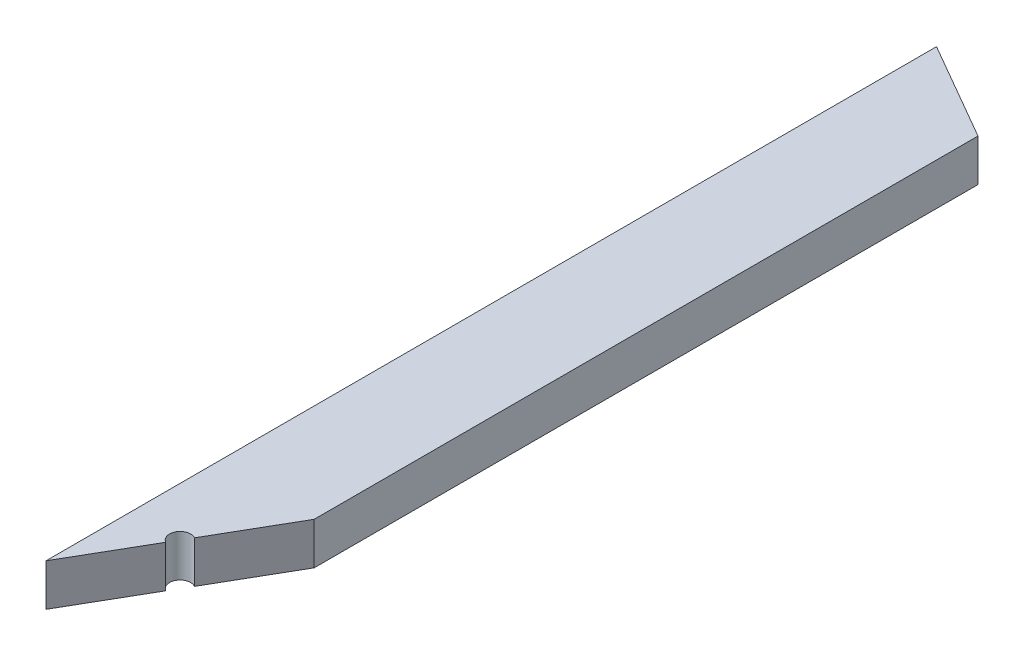
ISO-10303-21;
HEADER;
FILE_DESCRIPTION(('STEP AP214'),'2;1');
FILE_NAME('part.step','',(''),(''),'','','');
FILE_SCHEMA(('AUTOMOTIVE_DESIGN { 1 0 10303 214 1 1 1 1 }'));
ENDSEC;
DATA;
#1=APPLICATION_CONTEXT('core data for automotive mechanical design processes');
#2=APPLICATION_PROTOCOL_DEFINITION('international standard','automotive_design',2000,#1);
#3=PRODUCT_CONTEXT('',#1,'mechanical');
#4=PRODUCT('Part','Part','',(#3));
#5=PRODUCT_RELATED_PRODUCT_CATEGORY('part','',(#4));
#6=PRODUCT_DEFINITION_FORMATION('','',#4);
#7=PRODUCT_DEFINITION_CONTEXT('part definition',#1,'design');
#8=PRODUCT_DEFINITION('design','',#6,#7);
#9=PRODUCT_DEFINITION_SHAPE('','',#8);
#10=(LENGTH_UNIT() NAMED_UNIT(*) SI_UNIT(.MILLI.,.METRE.));
#11=(NAMED_UNIT(*) PLANE_ANGLE_UNIT() SI_UNIT($,.RADIAN.));
#12=(NAMED_UNIT(*) SI_UNIT($,.STERADIAN.) SOLID_ANGLE_UNIT());
#13=UNCERTAINTY_MEASURE_WITH_UNIT(LENGTH_MEASURE(1.E-05),#10,'distance_accuracy_value','');
#14=(GEOMETRIC_REPRESENTATION_CONTEXT(3) GLOBAL_UNCERTAINTY_ASSIGNED_CONTEXT((#13)) GLOBAL_UNIT_ASSIGNED_CONTEXT((#10,
#11,#12)) REPRESENTATION_CONTEXT('',''));
#15=CARTESIAN_POINT('',(0.,0.,0.));
#16=DIRECTION('',(0.,0.,1.));
#17=DIRECTION('',(1.,0.,0.));
#18=AXIS2_PLACEMENT_3D('',#15,#16,#17);
#19=CARTESIAN_POINT('',(-44.45,-19.05,806.55922));
#20=DIRECTION('',(-0.866025403784436,0.,-0.500000000000004));
#21=DIRECTION('',(-0.500000000000004,0.,0.866025403784436));
#22=AXIS2_PLACEMENT_3D('',#19,#20,#21);
#23=PLANE('',#22);
#24=DIRECTION('',(-0.500000000000004,0.,0.866025403784436));
#25=VECTOR('',#24,1.);
#26=CARTESIAN_POINT('',(-44.45,-19.05,806.55922));
#27=LINE('',#26,#25);
#28=CARTESIAN_POINT('',(-4.76250000000004,-19.05,737.818453574611));
#29=VERTEX_POINT('',#28);
#30=CARTESIAN_POINT('',(-44.45,-19.05,806.55922));
#31=VERTEX_POINT('',#30);
#32=EDGE_CURVE('E128',#29,#31,#27,.T.);
#33=ORIENTED_EDGE('',*,*,#32,.F.);
#34=DIRECTION('',(0.,1.,0.));
#35=VECTOR('',#34,1.);
#36=CARTESIAN_POINT('',(-4.76250000000004,-19.05,737.818453574611));
#37=LINE('',#36,#35);
#38=CARTESIAN_POINT('',(-4.76250000000004,19.05,737.818453574611));
#39=VERTEX_POINT('',#38);
#40=EDGE_CURVE('E11',#29,#39,#37,.T.);
#41=ORIENTED_EDGE('',*,*,#40,.T.);
#42=DIRECTION('',(-0.500000000000004,0.,0.866025403784436));
#43=VECTOR('',#42,1.);
#44=CARTESIAN_POINT('',(-44.45,19.05,806.55922));
#45=LINE('',#44,#43);
#46=CARTESIAN_POINT('',(-44.45,19.05,806.55922));
#47=VERTEX_POINT('',#46);
#48=EDGE_CURVE('E68',#39,#47,#45,.T.);
#49=ORIENTED_EDGE('',*,*,#48,.T.);
#50=DIRECTION('',(0.,-1.,0.));
#51=VECTOR('',#50,1.);
#52=CARTESIAN_POINT('',(-44.45,-19.05,806.55922));
#53=LINE('',#52,#51);
#54=EDGE_CURVE('E129',#47,#31,#53,.T.);
#55=ORIENTED_EDGE('',*,*,#54,.T.);
#56=EDGE_LOOP('',(#33,#41,#49,#55));
#57=FACE_BOUND('',#56,.T.);
#58=ADVANCED_FACE('F44',(#57),#23,.F.);
#59=CARTESIAN_POINT('',(44.45,-19.05,806.55922));
#60=DIRECTION('',(-1.,0.,0.));
#61=DIRECTION('',(0.,0.,1.));
#62=AXIS2_PLACEMENT_3D('',#59,#60,#61);
#63=PLANE('',#62);
#64=DIRECTION('',(0.,0.,-1.));
#65=VECTOR('',#64,1.);
#66=CARTESIAN_POINT('',(44.45,-19.05,806.55922));
#67=LINE('',#66,#65);
#68=CARTESIAN_POINT('',(44.45,-19.05,652.579903207128));
#69=VERTEX_POINT('',#68);
#70=CARTESIAN_POINT('',(44.45,-19.05,51.326438930957));
#71=VERTEX_POINT('',#70);
#72=EDGE_CURVE('E132',#69,#71,#67,.T.);
#73=ORIENTED_EDGE('',*,*,#72,.T.);
#74=DIRECTION('',(0.,1.,0.));
#75=VECTOR('',#74,1.);
#76=CARTESIAN_POINT('',(44.45,-19.05,51.326438930957));
#77=LINE('',#76,#75);
#78=CARTESIAN_POINT('',(44.45,19.05,51.326438930957));
#79=VERTEX_POINT('',#78);
#80=EDGE_CURVE('E137',#71,#79,#77,.T.);
#81=ORIENTED_EDGE('',*,*,#80,.T.);
#82=DIRECTION('',(0.,0.,-1.));
#83=VECTOR('',#82,1.);
#84=CARTESIAN_POINT('',(44.45,19.05,806.55922));
#85=LINE('',#84,#83);
#86=CARTESIAN_POINT('',(44.45,19.05,652.579903207128));
#87=VERTEX_POINT('',#86);
#88=EDGE_CURVE('E103',#87,#79,#85,.T.);
#89=ORIENTED_EDGE('',*,*,#88,.F.);
#90=DIRECTION('',(0.,1.,0.));
#91=VECTOR('',#90,1.);
#92=CARTESIAN_POINT('',(44.45,-19.05,652.579903207128));
#93=LINE('',#92,#91);
#94=EDGE_CURVE('E114',#69,#87,#93,.T.);
#95=ORIENTED_EDGE('',*,*,#94,.F.);
#96=EDGE_LOOP('',(#73,#81,#89,#95));
#97=FACE_BOUND('',#96,.T.);
#98=ADVANCED_FACE('F46',(#97),#63,.F.);
#99=CARTESIAN_POINT('',(-44.45,19.05,806.55922));
#100=DIRECTION('',(0.,-1.,0.));
#101=DIRECTION('',(0.,0.,-1.));
#102=AXIS2_PLACEMENT_3D('',#99,#100,#101);
#103=PLANE('',#102);
#104=ORIENTED_EDGE('',*,*,#48,.F.);
#105=CARTESIAN_POINT('',(0.,19.05,729.569561603564));
#106=DIRECTION('',(0.,1.,0.));
#107=DIRECTION('',(0.,0.,1.));
#108=AXIS2_PLACEMENT_3D('',#105,#106,#107);
#109=CIRCLE('',#108,9.525);
#110=CARTESIAN_POINT('',(4.76250000000003,19.05,721.320669632517));
#111=VERTEX_POINT('',#110);
#112=EDGE_CURVE('E98',#111,#39,#109,.T.);
#113=ORIENTED_EDGE('',*,*,#112,.F.);
#114=EDGE_CURVE('E108',#87,#111,#45,.T.);
#115=ORIENTED_EDGE('',*,*,#114,.F.);
#116=ORIENTED_EDGE('',*,*,#88,.T.);
#117=DIRECTION('',(0.866025403784442,0.,0.499999999999995));
#118=VECTOR('',#117,1.);
#119=CARTESIAN_POINT('',(44.45,19.05,51.326438930957));
#120=LINE('',#119,#118);
#121=CARTESIAN_POINT('',(-44.45,19.05,0.));
#122=VERTEX_POINT('',#121);
#123=EDGE_CURVE('E116',#122,#79,#120,.T.);
#124=ORIENTED_EDGE('',*,*,#123,.F.);
#125=DIRECTION('',(0.,0.,-1.));
#126=VECTOR('',#125,1.);
#127=CARTESIAN_POINT('',(-44.45,19.05,806.55922));
#128=LINE('',#127,#126);
#129=EDGE_CURVE('E145',#47,#122,#128,.T.);
#130=ORIENTED_EDGE('',*,*,#129,.F.);
#131=EDGE_LOOP('',(#104,#113,#115,#116,#124,#130));
#132=FACE_BOUND('',#131,.T.);
#133=ADVANCED_FACE('F106',(#132),#103,.F.);
#134=CARTESIAN_POINT('',(-44.45,-19.05,806.55922));
#135=DIRECTION('',(1.,0.,0.));
#136=DIRECTION('',(0.,0.,-1.));
#137=AXIS2_PLACEMENT_3D('',#134,#135,#136);
#138=PLANE('',#137);
#139=DIRECTION('',(0.,-1.,0.));
#140=VECTOR('',#139,1.);
#141=CARTESIAN_POINT('',(-44.45,-19.05,0.));
#142=LINE('',#141,#140);
#143=CARTESIAN_POINT('',(-44.45,-19.05,0.));
#144=VERTEX_POINT('',#143);
#145=EDGE_CURVE('E133',#122,#144,#142,.T.);
#146=ORIENTED_EDGE('',*,*,#145,.T.);
#147=DIRECTION('',(0.,0.,-1.));
#148=VECTOR('',#147,1.);
#149=CARTESIAN_POINT('',(-44.45,-19.05,806.55922));
#150=LINE('',#149,#148);
#151=EDGE_CURVE('E141',#31,#144,#150,.T.);
#152=ORIENTED_EDGE('',*,*,#151,.F.);
#153=ORIENTED_EDGE('',*,*,#54,.F.);
#154=ORIENTED_EDGE('',*,*,#129,.T.);
#155=EDGE_LOOP('',(#146,#152,#153,#154));
#156=FACE_BOUND('',#155,.T.);
#157=ADVANCED_FACE('F169',(#156),#138,.F.);
#158=CARTESIAN_POINT('',(-44.45,-19.05,806.55922));
#159=DIRECTION('',(0.,1.,0.));
#160=DIRECTION('',(0.,0.,1.));
#161=AXIS2_PLACEMENT_3D('',#158,#159,#160);
#162=PLANE('',#161);
#163=CARTESIAN_POINT('',(4.76250000000002,-19.05,721.320669632517));
#164=VERTEX_POINT('',#163);
#165=EDGE_CURVE('E122',#69,#164,#27,.T.);
#166=ORIENTED_EDGE('',*,*,#165,.T.);
#167=CARTESIAN_POINT('',(0.,-19.05,729.569561603564));
#168=DIRECTION('',(0.,1.,0.));
#169=DIRECTION('',(0.,0.,1.));
#170=AXIS2_PLACEMENT_3D('',#167,#168,#169);
#171=CIRCLE('',#170,9.525);
#172=EDGE_CURVE('E60',#164,#29,#171,.T.);
#173=ORIENTED_EDGE('',*,*,#172,.T.);
#174=ORIENTED_EDGE('',*,*,#32,.T.);
#175=ORIENTED_EDGE('',*,*,#151,.T.);
#176=DIRECTION('',(0.866025403784442,0.,0.499999999999995));
#177=VECTOR('',#176,1.);
#178=CARTESIAN_POINT('',(44.45,-19.05,51.326438930957));
#179=LINE('',#178,#177);
#180=EDGE_CURVE('E120',#144,#71,#179,.T.);
#181=ORIENTED_EDGE('',*,*,#180,.T.);
#182=ORIENTED_EDGE('',*,*,#72,.F.);
#183=EDGE_LOOP('',(#166,#173,#174,#175,#181,#182));
#184=FACE_BOUND('',#183,.T.);
#185=ADVANCED_FACE('F165',(#184),#162,.F.);
#186=CARTESIAN_POINT('',(44.45,-19.05,51.326438930957));
#187=DIRECTION('',(-0.499999999999995,0.,0.866025403784442));
#188=DIRECTION('',(0.866025403784442,0.,0.499999999999995));
#189=AXIS2_PLACEMENT_3D('',#186,#187,#188);
#190=PLANE('',#189);
#191=ORIENTED_EDGE('',*,*,#123,.T.);
#192=ORIENTED_EDGE('',*,*,#80,.F.);
#193=ORIENTED_EDGE('',*,*,#180,.F.);
#194=ORIENTED_EDGE('',*,*,#145,.F.);
#195=EDGE_LOOP('',(#191,#192,#193,#194));
#196=FACE_BOUND('',#195,.T.);
#197=ADVANCED_FACE('F170',(#196),#190,.F.);
#198=ORIENTED_EDGE('',*,*,#114,.T.);
#199=DIRECTION('',(0.,1.,0.));
#200=VECTOR('',#199,1.);
#201=CARTESIAN_POINT('',(4.76250000000003,-19.05,721.320669632517));
#202=LINE('',#201,#200);
#203=EDGE_CURVE('E53',#111,#164,#202,.F.);
#204=ORIENTED_EDGE('',*,*,#203,.T.);
#205=ORIENTED_EDGE('',*,*,#165,.F.);
#206=ORIENTED_EDGE('',*,*,#94,.T.);
#207=EDGE_LOOP('',(#198,#204,#205,#206));
#208=FACE_BOUND('',#207,.T.);
#209=ADVANCED_FACE('F112',(#208),#23,.F.);
#210=CARTESIAN_POINT('',(0.,-19.05,729.569561603564));
#211=DIRECTION('',(0.,1.,0.));
#212=DIRECTION('',(0.,0.,1.));
#213=AXIS2_PLACEMENT_3D('',#210,#211,#212);
#214=CYLINDRICAL_SURFACE('',#213,9.525);
#215=ORIENTED_EDGE('',*,*,#172,.F.);
#216=ORIENTED_EDGE('',*,*,#203,.F.);
#217=ORIENTED_EDGE('',*,*,#112,.T.);
#218=ORIENTED_EDGE('',*,*,#40,.F.);
#219=EDGE_LOOP('',(#215,#216,#217,#218));
#220=FACE_BOUND('',#219,.T.);
#221=ADVANCED_FACE('F97',(#220),#214,.F.);
#222=CLOSED_SHELL('',(#58,#98,#133,#157,#185,#197,#209,#221));
#223=MANIFOLD_SOLID_BREP('B2',#222);
#224=ADVANCED_BREP_SHAPE_REPRESENTATION('',(#18,#223),#14);
#225=SHAPE_DEFINITION_REPRESENTATION(#9,#224);
ENDSEC;
END-ISO-10303-21;
